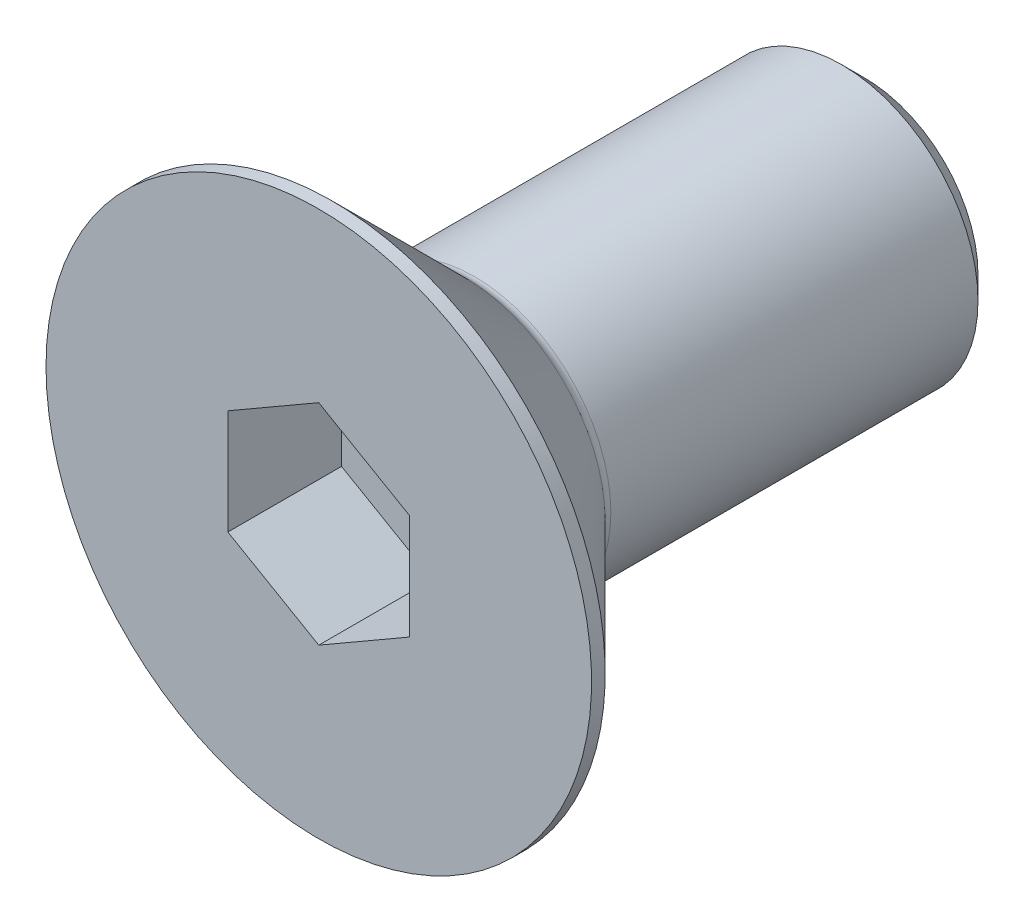
ISO-10303-21;
HEADER;
FILE_DESCRIPTION(('STEP AP214'),'2;1');
FILE_NAME('part.step','',(''),(''),'','','');
FILE_SCHEMA(('AUTOMOTIVE_DESIGN { 1 0 10303 214 1 1 1 1 }'));
ENDSEC;
DATA;
#1=APPLICATION_CONTEXT('core data for automotive mechanical design processes');
#2=APPLICATION_PROTOCOL_DEFINITION('international standard','automotive_design',2000,#1);
#3=PRODUCT_CONTEXT('',#1,'mechanical');
#4=PRODUCT('Part','Part','',(#3));
#5=PRODUCT_RELATED_PRODUCT_CATEGORY('part','',(#4));
#6=PRODUCT_DEFINITION_FORMATION('','',#4);
#7=PRODUCT_DEFINITION_CONTEXT('part definition',#1,'design');
#8=PRODUCT_DEFINITION('design','',#6,#7);
#9=PRODUCT_DEFINITION_SHAPE('','',#8);
#10=(LENGTH_UNIT() NAMED_UNIT(*) SI_UNIT(.MILLI.,.METRE.));
#11=(NAMED_UNIT(*) PLANE_ANGLE_UNIT() SI_UNIT($,.RADIAN.));
#12=(NAMED_UNIT(*) SI_UNIT($,.STERADIAN.) SOLID_ANGLE_UNIT());
#13=UNCERTAINTY_MEASURE_WITH_UNIT(LENGTH_MEASURE(1.E-05),#10,'distance_accuracy_value','');
#14=(GEOMETRIC_REPRESENTATION_CONTEXT(3) GLOBAL_UNCERTAINTY_ASSIGNED_CONTEXT((#13)) GLOBAL_UNIT_ASSIGNED_CONTEXT((#10,
#11,#12)) REPRESENTATION_CONTEXT('',''));
#15=CARTESIAN_POINT('',(0.,0.,0.));
#16=DIRECTION('',(0.,0.,1.));
#17=DIRECTION('',(1.,0.,0.));
#18=AXIS2_PLACEMENT_3D('',#15,#16,#17);
#19=CARTESIAN_POINT('',(1.5,0.,-12.));
#20=DIRECTION('',(0.,0.,-1.));
#21=DIRECTION('',(-1.,0.,0.));
#22=AXIS2_PLACEMENT_3D('',#19,#20,#21);
#23=PLANE('',#22);
#24=CARTESIAN_POINT('',(0.,0.,-12.0000000000005));
#25=DIRECTION('',(0.,0.,1.));
#26=DIRECTION('',(1.,0.,0.));
#27=AXIS2_PLACEMENT_3D('',#24,#25,#26);
#28=CIRCLE('',#27,2.49999999994088);
#29=CARTESIAN_POINT('',(2.49999999994088,0.,-12.0000000000005));
#30=VERTEX_POINT('',#29);
#31=EDGE_CURVE('E20',#30,#30,#28,.T.);
#32=ORIENTED_EDGE('',*,*,#31,.F.);
#33=EDGE_LOOP('',(#32));
#34=FACE_BOUND('',#33,.T.);
#35=ADVANCED_FACE('F17',(#34),#23,.T.);
#36=CARTESIAN_POINT('',(0.,0.,-11.4999999999554));
#37=DIRECTION('',(0.,0.,1.));
#38=DIRECTION('',(1.,0.,0.));
#39=AXIS2_PLACEMENT_3D('',#36,#37,#38);
#40=CONICAL_SURFACE('',#39,3.00000000004275,0.785398163454292);
#41=ORIENTED_EDGE('',*,*,#31,.T.);
#42=EDGE_LOOP('',(#41));
#43=FACE_BOUND('',#42,.T.);
#44=CARTESIAN_POINT('',(0.,0.,-11.5));
#45=DIRECTION('',(0.,0.,-1.));
#46=DIRECTION('',(-1.,0.,0.));
#47=AXIS2_PLACEMENT_3D('',#44,#45,#46);
#48=CIRCLE('',#47,3.);
#49=CARTESIAN_POINT('',(-3.,0.,-11.5));
#50=VERTEX_POINT('',#49);
#51=EDGE_CURVE('E229',#50,#50,#48,.F.);
#52=ORIENTED_EDGE('',*,*,#51,.F.);
#53=EDGE_LOOP('',(#52));
#54=FACE_BOUND('',#53,.T.);
#55=ADVANCED_FACE('F115',(#43,#54),#40,.T.);
#56=CARTESIAN_POINT('',(0.,0.,-7.65));
#57=DIRECTION('',(0.,0.,-1.));
#58=DIRECTION('',(-1.,0.,0.));
#59=AXIS2_PLACEMENT_3D('',#56,#57,#58);
#60=CYLINDRICAL_SURFACE('',#59,3.);
#61=ORIENTED_EDGE('',*,*,#51,.T.);
#62=EDGE_LOOP('',(#61));
#63=FACE_BOUND('',#62,.T.);
#64=CARTESIAN_POINT('',(0.,0.,-3.42426406927));
#65=DIRECTION('',(0.,0.,-1.));
#66=DIRECTION('',(1.,0.,0.));
#67=AXIS2_PLACEMENT_3D('',#64,#65,#66);
#68=CIRCLE('',#67,3.);
#69=CARTESIAN_POINT('',(3.,0.,-3.42426406927));
#70=VERTEX_POINT('',#69);
#71=EDGE_CURVE('E101',#70,#70,#68,.T.);
#72=ORIENTED_EDGE('',*,*,#71,.T.);
#73=EDGE_LOOP('',(#72));
#74=FACE_BOUND('',#73,.T.);
#75=ADVANCED_FACE('F111',(#63,#74),#60,.T.);
#76=CARTESIAN_POINT('',(0.,0.,-3.42426406871));
#77=DIRECTION('',(0.,0.,-1.));
#78=DIRECTION('',(1.,0.,0.));
#79=AXIS2_PLACEMENT_3D('',#76,#77,#78);
#80=TOROIDAL_SURFACE('',#79,3.3,0.3);
#81=ORIENTED_EDGE('',*,*,#71,.F.);
#82=EDGE_LOOP('',(#81));
#83=FACE_BOUND('',#82,.T.);
#84=CARTESIAN_POINT('',(0.,0.,-3.21213203437765));
#85=DIRECTION('',(0.,0.,1.));
#86=DIRECTION('',(-1.,0.,0.));
#87=AXIS2_PLACEMENT_3D('',#84,#85,#86);
#88=CIRCLE('',#87,3.08786796563254);
#89=CARTESIAN_POINT('',(-3.08786796563254,0.,-3.21213203437765));
#90=VERTEX_POINT('',#89);
#91=EDGE_CURVE('E98',#90,#90,#88,.T.);
#92=ORIENTED_EDGE('',*,*,#91,.F.);
#93=EDGE_LOOP('',(#92));
#94=FACE_BOUND('',#93,.T.);
#95=ADVANCED_FACE('F106',(#83,#94),#80,.F.);
#96=CARTESIAN_POINT('',(0.,0.,-0.299999999924694));
#97=DIRECTION('',(0.,0.,1.));
#98=DIRECTION('',(1.,0.,0.));
#99=AXIS2_PLACEMENT_3D('',#96,#97,#98);
#100=CONICAL_SURFACE('',#99,6.00000000008549,0.785398163397448);
#101=ORIENTED_EDGE('',*,*,#91,.T.);
#102=EDGE_LOOP('',(#101));
#103=FACE_BOUND('',#102,.T.);
#104=CARTESIAN_POINT('',(0.,0.,-0.300000000004));
#105=DIRECTION('',(0.,0.,-1.));
#106=DIRECTION('',(-1.,0.,0.));
#107=AXIS2_PLACEMENT_3D('',#104,#105,#106);
#108=CIRCLE('',#107,6.);
#109=CARTESIAN_POINT('',(-6.,0.,-0.300000000004));
#110=VERTEX_POINT('',#109);
#111=EDGE_CURVE('E81',#110,#110,#108,.F.);
#112=ORIENTED_EDGE('',*,*,#111,.F.);
#113=EDGE_LOOP('',(#112));
#114=FACE_BOUND('',#113,.T.);
#115=ADVANCED_FACE('F110',(#103,#114),#100,.T.);
#116=CARTESIAN_POINT('',(0.,0.,-2.5));
#117=DIRECTION('',(0.,0.,1.));
#118=DIRECTION('',(1.,0.,0.));
#119=AXIS2_PLACEMENT_3D('',#116,#117,#118);
#120=PLANE('',#119);
#121=DIRECTION('',(-0.866025403784329,-0.50000000000019,0.));
#122=VECTOR('',#121,1.);
#123=CARTESIAN_POINT('',(0.,2.30940107676,-2.5));
#124=LINE('',#123,#122);
#125=CARTESIAN_POINT('',(3.05749247274227E-10,2.30940107669917,-2.5));
#126=VERTEX_POINT('',#125);
#127=CARTESIAN_POINT('',(-1.99999999979574,1.15470053861129,-2.5));
#128=VERTEX_POINT('',#127);
#129=EDGE_CURVE('E85',#126,#128,#124,.T.);
#130=ORIENTED_EDGE('',*,*,#129,.T.);
#131=DIRECTION('',(0.,-1.,0.));
#132=VECTOR('',#131,1.);
#133=CARTESIAN_POINT('',(-2.,1.15470053838,-2.5));
#134=LINE('',#133,#132);
#135=CARTESIAN_POINT('',(-1.9999999998975,-1.15470053843918,-2.5));
#136=VERTEX_POINT('',#135);
#137=EDGE_CURVE('E67',#128,#136,#134,.T.);
#138=ORIENTED_EDGE('',*,*,#137,.T.);
#139=DIRECTION('',(0.866025403784329,-0.50000000000019,0.));
#140=VECTOR('',#139,1.);
#141=CARTESIAN_POINT('',(-2.,-1.15470053838,-2.5));
#142=LINE('',#141,#140);
#143=CARTESIAN_POINT('',(-3.57692966018253E-10,-2.30940107661074,-2.5));
#144=VERTEX_POINT('',#143);
#145=EDGE_CURVE('E72',#136,#144,#142,.T.);
#146=ORIENTED_EDGE('',*,*,#145,.T.);
#147=DIRECTION('',(0.866025403784329,0.50000000000019,0.));
#148=VECTOR('',#147,1.);
#149=CARTESIAN_POINT('',(0.,-2.30940107676,-2.5));
#150=LINE('',#149,#148);
#151=CARTESIAN_POINT('',(1.99999999979574,-1.15470053861129,-2.5));
#152=VERTEX_POINT('',#151);
#153=EDGE_CURVE('E226',#144,#152,#150,.T.);
#154=ORIENTED_EDGE('',*,*,#153,.T.);
#155=DIRECTION('',(0.,1.,0.));
#156=VECTOR('',#155,1.);
#157=CARTESIAN_POINT('',(2.,-1.15470053838,-2.5));
#158=LINE('',#157,#156);
#159=CARTESIAN_POINT('',(1.99999999999926,1.15470053814543,-2.5));
#160=VERTEX_POINT('',#159);
#161=EDGE_CURVE('E241',#152,#160,#158,.T.);
#162=ORIENTED_EDGE('',*,*,#161,.T.);
#163=DIRECTION('',(-0.866025403784329,0.50000000000019,0.));
#164=VECTOR('',#163,1.);
#165=CARTESIAN_POINT('',(2.,1.15470053838,-2.5));
#166=LINE('',#165,#164);
#167=EDGE_CURVE('E245',#160,#126,#166,.T.);
#168=ORIENTED_EDGE('',*,*,#167,.T.);
#169=EDGE_LOOP('',(#130,#138,#146,#154,#162,#168));
#170=FACE_BOUND('',#169,.T.);
#171=ADVANCED_FACE('F83',(#170),#120,.T.);
#172=CARTESIAN_POINT('',(0.,0.,-0.15));
#173=DIRECTION('',(0.,0.,-1.));
#174=DIRECTION('',(-1.,0.,0.));
#175=AXIS2_PLACEMENT_3D('',#172,#173,#174);
#176=CYLINDRICAL_SURFACE('',#175,6.);
#177=CARTESIAN_POINT('',(0.,0.,3.72528044653361E-10));
#178=DIRECTION('',(0.,0.,-1.));
#179=DIRECTION('',(-1.,0.,0.));
#180=AXIS2_PLACEMENT_3D('',#177,#178,#179);
#181=CIRCLE('',#180,6.);
#182=CARTESIAN_POINT('',(-6.,0.,3.72528044653361E-10));
#183=VERTEX_POINT('',#182);
#184=EDGE_CURVE('E224',#183,#183,#181,.F.);
#185=ORIENTED_EDGE('',*,*,#184,.F.);
#186=EDGE_LOOP('',(#185));
#187=FACE_BOUND('',#186,.T.);
#188=ORIENTED_EDGE('',*,*,#111,.T.);
#189=EDGE_LOOP('',(#188));
#190=FACE_BOUND('',#189,.T.);
#191=ADVANCED_FACE('F154',(#187,#190),#176,.T.);
#192=CARTESIAN_POINT('',(-2.,-1.15470053838,0.));
#193=DIRECTION('',(-0.50000000000019,-0.866025403784329,0.));
#194=DIRECTION('',(0.866025403784329,-0.50000000000019,0.));
#195=AXIS2_PLACEMENT_3D('',#192,#193,#194);
#196=PLANE('',#195);
#197=DIRECTION('',(0.,0.,1.));
#198=VECTOR('',#197,1.);
#199=CARTESIAN_POINT('',(-2.,-1.15470053838,0.));
#200=LINE('',#199,#198);
#201=CARTESIAN_POINT('',(-2.,-1.15470053838,0.));
#202=VERTEX_POINT('',#201);
#203=EDGE_CURVE('E74',#136,#202,#200,.T.);
#204=ORIENTED_EDGE('',*,*,#203,.T.);
#205=DIRECTION('',(-0.866025403785098,0.499999999998858,0.));
#206=VECTOR('',#205,1.);
#207=CARTESIAN_POINT('',(-4.08305333987613E-10,-2.30940107652,0.));
#208=LINE('',#207,#206);
#209=CARTESIAN_POINT('',(-3.57693051975814E-10,-2.30940107661074,0.));
#210=VERTEX_POINT('',#209);
#211=EDGE_CURVE('E225',#210,#202,#208,.T.);
#212=ORIENTED_EDGE('',*,*,#211,.F.);
#213=DIRECTION('',(0.,0.,1.));
#214=VECTOR('',#213,1.);
#215=CARTESIAN_POINT('',(-2.02305599143558E-10,-2.3094010768768,0.));
#216=LINE('',#215,#214);
#217=EDGE_CURVE('E77',#210,#144,#216,.F.);
#218=ORIENTED_EDGE('',*,*,#217,.T.);
#219=ORIENTED_EDGE('',*,*,#145,.F.);
#220=EDGE_LOOP('',(#204,#212,#218,#219));
#221=FACE_BOUND('',#220,.T.);
#222=ADVANCED_FACE('F73',(#221),#196,.F.);
#223=CARTESIAN_POINT('',(-2.,1.15470053838,0.));
#224=DIRECTION('',(-1.,0.,0.));
#225=DIRECTION('',(0.,-1.,0.));
#226=AXIS2_PLACEMENT_3D('',#223,#224,#225);
#227=PLANE('',#226);
#228=DIRECTION('',(0.,0.,1.));
#229=VECTOR('',#228,1.);
#230=CARTESIAN_POINT('',(-1.99999999959298,1.15470053861516,0.));
#231=LINE('',#230,#229);
#232=CARTESIAN_POINT('',(-1.99999999989824,1.15470053855211,0.));
#233=VERTEX_POINT('',#232);
#234=EDGE_CURVE('E87',#128,#233,#231,.T.);
#235=ORIENTED_EDGE('',*,*,#234,.T.);
#236=DIRECTION('',(0.,1.,0.));
#237=VECTOR('',#236,1.);
#238=CARTESIAN_POINT('',(-2.,0.,0.));
#239=LINE('',#238,#237);
#240=EDGE_CURVE('E91',#202,#233,#239,.T.);
#241=ORIENTED_EDGE('',*,*,#240,.F.);
#242=ORIENTED_EDGE('',*,*,#203,.F.);
#243=ORIENTED_EDGE('',*,*,#137,.F.);
#244=EDGE_LOOP('',(#235,#241,#242,#243));
#245=FACE_BOUND('',#244,.T.);
#246=ADVANCED_FACE('F89',(#245),#227,.F.);
#247=CARTESIAN_POINT('',(0.,2.30940107676,0.));
#248=DIRECTION('',(-0.50000000000019,0.866025403784329,0.));
#249=DIRECTION('',(-0.866025403784329,-0.50000000000019,0.));
#250=AXIS2_PLACEMENT_3D('',#247,#248,#249);
#251=PLANE('',#250);
#252=DIRECTION('',(0.,0.,1.));
#253=VECTOR('',#252,1.);
#254=CARTESIAN_POINT('',(4.10080823465275E-10,2.30940107652308,0.));
#255=LINE('',#254,#253);
#256=CARTESIAN_POINT('',(3.05749323872427E-10,2.30940107669917,0.));
#257=VERTEX_POINT('',#256);
#258=EDGE_CURVE('E247',#126,#257,#255,.T.);
#259=ORIENTED_EDGE('',*,*,#258,.T.);
#260=DIRECTION('',(0.86602540387224,0.499999999847924,0.));
#261=VECTOR('',#260,1.);
#262=CARTESIAN_POINT('',(-1.99999999959,1.15470053861,0.));
#263=LINE('',#262,#261);
#264=EDGE_CURVE('E251',#233,#257,#263,.T.);
#265=ORIENTED_EDGE('',*,*,#264,.F.);
#266=ORIENTED_EDGE('',*,*,#234,.F.);
#267=ORIENTED_EDGE('',*,*,#129,.F.);
#268=EDGE_LOOP('',(#259,#265,#266,#267));
#269=FACE_BOUND('',#268,.T.);
#270=ADVANCED_FACE('F145',(#269),#251,.F.);
#271=CARTESIAN_POINT('',(2.,1.15470053838,0.));
#272=DIRECTION('',(0.50000000000019,0.866025403784329,0.));
#273=DIRECTION('',(-0.866025403784329,0.50000000000019,0.));
#274=AXIS2_PLACEMENT_3D('',#271,#272,#273);
#275=PLANE('',#274);
#276=DIRECTION('',(0.,0.,-1.));
#277=VECTOR('',#276,1.);
#278=CARTESIAN_POINT('',(2.,1.15470053791,0.));
#279=LINE('',#278,#277);
#280=CARTESIAN_POINT('',(2.00000000010176,1.15470053808625,0.));
#281=VERTEX_POINT('',#280);
#282=EDGE_CURVE('E243',#160,#281,#279,.F.);
#283=ORIENTED_EDGE('',*,*,#282,.T.);
#284=DIRECTION('',(0.866025403696973,-0.500000000151495,0.));
#285=VECTOR('',#284,1.);
#286=CARTESIAN_POINT('',(4.08305333987613E-10,2.30940107652,0.));
#287=LINE('',#286,#285);
#288=EDGE_CURVE('E255',#257,#281,#287,.T.);
#289=ORIENTED_EDGE('',*,*,#288,.F.);
#290=ORIENTED_EDGE('',*,*,#258,.F.);
#291=ORIENTED_EDGE('',*,*,#167,.F.);
#292=EDGE_LOOP('',(#283,#289,#290,#291));
#293=FACE_BOUND('',#292,.T.);
#294=ADVANCED_FACE('F142',(#293),#275,.F.);
#295=CARTESIAN_POINT('',(2.,-1.15470053838,0.));
#296=DIRECTION('',(1.,0.,0.));
#297=DIRECTION('',(0.,0.,-1.));
#298=AXIS2_PLACEMENT_3D('',#295,#296,#297);
#299=PLANE('',#298);
#300=DIRECTION('',(0.,0.,1.));
#301=VECTOR('',#300,1.);
#302=CARTESIAN_POINT('',(1.99999999959298,-1.15470053861516,0.));
#303=LINE('',#302,#301);
#304=CARTESIAN_POINT('',(1.99999999989824,-1.15470053855211,0.));
#305=VERTEX_POINT('',#304);
#306=EDGE_CURVE('E35',#152,#305,#303,.T.);
#307=ORIENTED_EDGE('',*,*,#306,.T.);
#308=DIRECTION('',(0.,1.,0.));
#309=VECTOR('',#308,1.);
#310=CARTESIAN_POINT('',(2.,0.,0.));
#311=LINE('',#310,#309);
#312=EDGE_CURVE('E26',#281,#305,#311,.F.);
#313=ORIENTED_EDGE('',*,*,#312,.F.);
#314=ORIENTED_EDGE('',*,*,#282,.F.);
#315=ORIENTED_EDGE('',*,*,#161,.F.);
#316=EDGE_LOOP('',(#307,#313,#314,#315));
#317=FACE_BOUND('',#316,.T.);
#318=ADVANCED_FACE('F134',(#317),#299,.F.);
#319=CARTESIAN_POINT('',(0.,-2.30940107676,0.));
#320=DIRECTION('',(0.50000000000019,-0.866025403784329,0.));
#321=DIRECTION('',(0.866025403784329,0.50000000000019,0.));
#322=AXIS2_PLACEMENT_3D('',#319,#320,#321);
#323=PLANE('',#322);
#324=ORIENTED_EDGE('',*,*,#217,.F.);
#325=DIRECTION('',(-0.86602540387224,-0.499999999847924,0.));
#326=VECTOR('',#325,1.);
#327=CARTESIAN_POINT('',(1.99999999959,-1.15470053861,0.));
#328=LINE('',#327,#326);
#329=EDGE_CURVE('E11',#305,#210,#328,.T.);
#330=ORIENTED_EDGE('',*,*,#329,.F.);
#331=ORIENTED_EDGE('',*,*,#306,.F.);
#332=ORIENTED_EDGE('',*,*,#153,.F.);
#333=EDGE_LOOP('',(#324,#330,#331,#332));
#334=FACE_BOUND('',#333,.T.);
#335=ADVANCED_FACE('F128',(#334),#323,.F.);
#336=CARTESIAN_POINT('',(3.,0.,0.));
#337=DIRECTION('',(0.,0.,1.));
#338=DIRECTION('',(1.,0.,0.));
#339=AXIS2_PLACEMENT_3D('',#336,#337,#338);
#340=PLANE('',#339);
#341=ORIENTED_EDGE('',*,*,#312,.T.);
#342=ORIENTED_EDGE('',*,*,#329,.T.);
#343=ORIENTED_EDGE('',*,*,#211,.T.);
#344=ORIENTED_EDGE('',*,*,#240,.T.);
#345=ORIENTED_EDGE('',*,*,#264,.T.);
#346=ORIENTED_EDGE('',*,*,#288,.T.);
#347=EDGE_LOOP('',(#341,#342,#343,#344,#345,#346));
#348=FACE_BOUND('',#347,.T.);
#349=ORIENTED_EDGE('',*,*,#184,.T.);
#350=EDGE_LOOP('',(#349));
#351=FACE_BOUND('',#350,.T.);
#352=ADVANCED_FACE('F126',(#348,#351),#340,.T.);
#353=CLOSED_SHELL('',(#35,#55,#75,#95,#115,#171,#191,#222,#246,#270,#294,#318,#335,#352));
#354=MANIFOLD_SOLID_BREP('B1',#353);
#355=ADVANCED_BREP_SHAPE_REPRESENTATION('',(#18,#354),#14);
#356=SHAPE_DEFINITION_REPRESENTATION(#9,#355);
ENDSEC;
END-ISO-10303-21;
